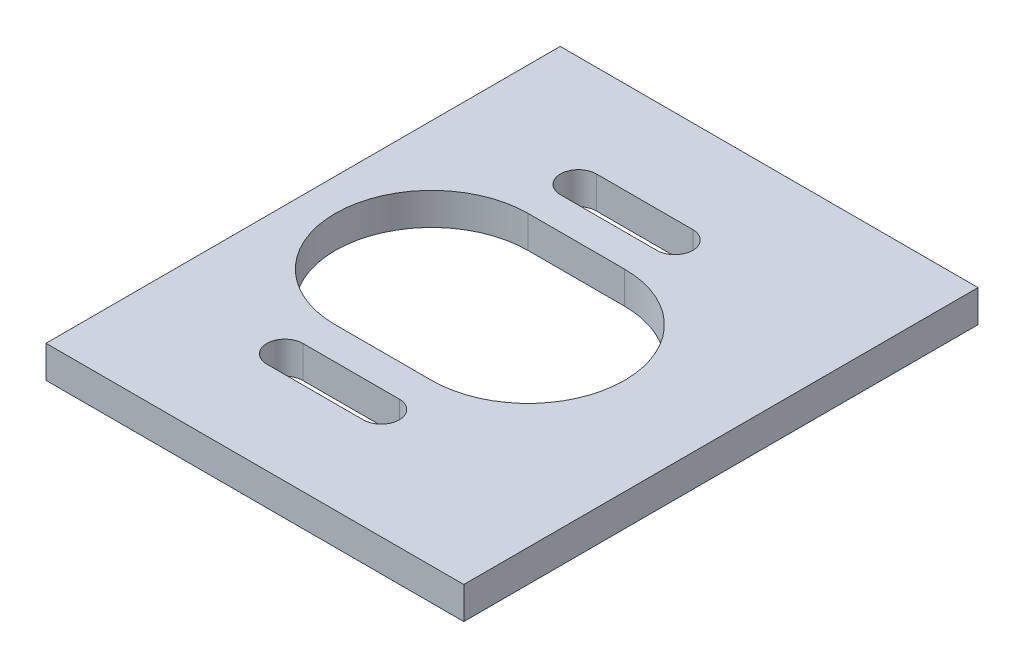
ISO-10303-21;
HEADER;
FILE_DESCRIPTION(('STEP AP214'),'2;1');
FILE_NAME('part.step','',(''),(''),'','','');
FILE_SCHEMA(('AUTOMOTIVE_DESIGN { 1 0 10303 214 1 1 1 1 }'));
ENDSEC;
DATA;
#1=APPLICATION_CONTEXT('core data for automotive mechanical design processes');
#2=APPLICATION_PROTOCOL_DEFINITION('international standard','automotive_design',2000,#1);
#3=PRODUCT_CONTEXT('',#1,'mechanical');
#4=PRODUCT('Part','Part','',(#3));
#5=PRODUCT_RELATED_PRODUCT_CATEGORY('part','',(#4));
#6=PRODUCT_DEFINITION_FORMATION('','',#4);
#7=PRODUCT_DEFINITION_CONTEXT('part definition',#1,'design');
#8=PRODUCT_DEFINITION('design','',#6,#7);
#9=PRODUCT_DEFINITION_SHAPE('','',#8);
#10=(LENGTH_UNIT() NAMED_UNIT(*) SI_UNIT(.MILLI.,.METRE.));
#11=(NAMED_UNIT(*) PLANE_ANGLE_UNIT() SI_UNIT($,.RADIAN.));
#12=(NAMED_UNIT(*) SI_UNIT($,.STERADIAN.) SOLID_ANGLE_UNIT());
#13=UNCERTAINTY_MEASURE_WITH_UNIT(LENGTH_MEASURE(1.E-05),#10,'distance_accuracy_value','');
#14=(GEOMETRIC_REPRESENTATION_CONTEXT(3) GLOBAL_UNCERTAINTY_ASSIGNED_CONTEXT((#13)) GLOBAL_UNIT_ASSIGNED_CONTEXT((#10,
#11,#12)) REPRESENTATION_CONTEXT('',''));
#15=CARTESIAN_POINT('',(0.,0.,0.));
#16=DIRECTION('',(0.,0.,1.));
#17=DIRECTION('',(1.,0.,0.));
#18=AXIS2_PLACEMENT_3D('',#15,#16,#17);
#19=CARTESIAN_POINT('',(0.,3.175,0.));
#20=DIRECTION('',(0.,1.,0.));
#21=DIRECTION('',(0.,0.,1.));
#22=AXIS2_PLACEMENT_3D('',#19,#20,#21);
#23=PLANE('',#22);
#24=DIRECTION('',(0.,0.,-1.));
#25=VECTOR('',#24,1.);
#26=CARTESIAN_POINT('',(53.975,3.175,-25.4));
#27=LINE('',#26,#25);
#28=CARTESIAN_POINT('',(53.975,3.175,25.4));
#29=VERTEX_POINT('',#28);
#30=CARTESIAN_POINT('',(53.975,3.175,-25.4));
#31=VERTEX_POINT('',#30);
#32=EDGE_CURVE('E174',#29,#31,#27,.T.);
#33=ORIENTED_EDGE('',*,*,#32,.F.);
#34=DIRECTION('',(1.,0.,0.));
#35=VECTOR('',#34,1.);
#36=CARTESIAN_POINT('',(-88.9,3.175,25.4));
#37=LINE('',#36,#35);
#38=CARTESIAN_POINT('',(95.25,3.175,25.4));
#39=VERTEX_POINT('',#38);
#40=EDGE_CURVE('E11',#29,#39,#37,.T.);
#41=ORIENTED_EDGE('',*,*,#40,.T.);
#42=DIRECTION('',(0.,0.,1.));
#43=VECTOR('',#42,1.);
#44=CARTESIAN_POINT('',(95.25,3.175,25.4));
#45=LINE('',#44,#43);
#46=CARTESIAN_POINT('',(95.25,3.175,-25.4));
#47=VERTEX_POINT('',#46);
#48=EDGE_CURVE('E169',#47,#39,#45,.T.);
#49=ORIENTED_EDGE('',*,*,#48,.F.);
#50=DIRECTION('',(-1.,0.,0.));
#51=VECTOR('',#50,1.);
#52=CARTESIAN_POINT('',(-88.9,3.175,-25.4));
#53=LINE('',#52,#51);
#54=EDGE_CURVE('E41',#47,#31,#53,.T.);
#55=ORIENTED_EDGE('',*,*,#54,.T.);
#56=EDGE_LOOP('',(#33,#41,#49,#55));
#57=FACE_BOUND('',#56,.T.);
#58=DIRECTION('',(1.,0.,0.));
#59=VECTOR('',#58,1.);
#60=CARTESIAN_POINT('',(76.2,3.175,12.722));
#61=LINE('',#60,#59);
#62=CARTESIAN_POINT('',(66.675,3.175,12.722));
#63=VERTEX_POINT('',#62);
#64=CARTESIAN_POINT('',(76.2,3.175,12.722));
#65=VERTEX_POINT('',#64);
#66=EDGE_CURVE('E253',#63,#65,#61,.T.);
#67=ORIENTED_EDGE('',*,*,#66,.T.);
#68=CARTESIAN_POINT('',(76.2,3.175,14.5));
#69=DIRECTION('',(0.,-1.,0.));
#70=DIRECTION('',(0.,0.,1.));
#71=AXIS2_PLACEMENT_3D('',#68,#69,#70);
#72=CIRCLE('',#71,1.77799999999999);
#73=CARTESIAN_POINT('',(76.2,3.175,16.278));
#74=VERTEX_POINT('',#73);
#75=EDGE_CURVE('E205',#65,#74,#72,.T.);
#76=ORIENTED_EDGE('',*,*,#75,.T.);
#77=DIRECTION('',(-1.,0.,0.));
#78=VECTOR('',#77,1.);
#79=CARTESIAN_POINT('',(76.2,3.175,16.278));
#80=LINE('',#79,#78);
#81=CARTESIAN_POINT('',(66.675,3.175,16.278));
#82=VERTEX_POINT('',#81);
#83=EDGE_CURVE('E243',#74,#82,#80,.T.);
#84=ORIENTED_EDGE('',*,*,#83,.T.);
#85=CARTESIAN_POINT('',(66.675,3.175,14.5));
#86=DIRECTION('',(0.,-1.,0.));
#87=DIRECTION('',(0.,0.,1.));
#88=AXIS2_PLACEMENT_3D('',#85,#86,#87);
#89=CIRCLE('',#88,1.77799999999997);
#90=EDGE_CURVE('E256',#82,#63,#89,.T.);
#91=ORIENTED_EDGE('',*,*,#90,.T.);
#92=EDGE_LOOP('',(#67,#76,#84,#91));
#93=FACE_BOUND('',#92,.T.);
#94=DIRECTION('',(-1.,0.,0.));
#95=VECTOR('',#94,1.);
#96=CARTESIAN_POINT('',(66.675,3.175,9.525));
#97=LINE('',#96,#95);
#98=CARTESIAN_POINT('',(76.2,3.175,9.525));
#99=VERTEX_POINT('',#98);
#100=CARTESIAN_POINT('',(66.675,3.175,9.525));
#101=VERTEX_POINT('',#100);
#102=EDGE_CURVE('E224',#99,#101,#97,.T.);
#103=ORIENTED_EDGE('',*,*,#102,.T.);
#104=CARTESIAN_POINT('',(66.675,3.175,0.));
#105=DIRECTION('',(0.,-1.,0.));
#106=DIRECTION('',(0.,0.,1.));
#107=AXIS2_PLACEMENT_3D('',#104,#105,#106);
#108=CIRCLE('',#107,9.525);
#109=CARTESIAN_POINT('',(66.675,3.175,-9.525));
#110=VERTEX_POINT('',#109);
#111=EDGE_CURVE('E179',#101,#110,#108,.T.);
#112=ORIENTED_EDGE('',*,*,#111,.T.);
#113=DIRECTION('',(1.,0.,0.));
#114=VECTOR('',#113,1.);
#115=CARTESIAN_POINT('',(66.675,3.175,-9.525));
#116=LINE('',#115,#114);
#117=CARTESIAN_POINT('',(76.2,3.175,-9.525));
#118=VERTEX_POINT('',#117);
#119=EDGE_CURVE('E214',#110,#118,#116,.T.);
#120=ORIENTED_EDGE('',*,*,#119,.T.);
#121=CARTESIAN_POINT('',(76.2,3.175,0.));
#122=DIRECTION('',(0.,-1.,0.));
#123=DIRECTION('',(0.,0.,1.));
#124=AXIS2_PLACEMENT_3D('',#121,#122,#123);
#125=CIRCLE('',#124,9.525);
#126=EDGE_CURVE('E227',#118,#99,#125,.T.);
#127=ORIENTED_EDGE('',*,*,#126,.T.);
#128=EDGE_LOOP('',(#103,#112,#120,#127));
#129=FACE_BOUND('',#128,.T.);
#130=DIRECTION('',(-1.,0.,0.));
#131=VECTOR('',#130,1.);
#132=CARTESIAN_POINT('',(66.675,3.175,-12.722));
#133=LINE('',#132,#131);
#134=CARTESIAN_POINT('',(76.2,3.175,-12.722));
#135=VERTEX_POINT('',#134);
#136=CARTESIAN_POINT('',(66.675,3.175,-12.722));
#137=VERTEX_POINT('',#136);
#138=EDGE_CURVE('E194',#135,#137,#133,.T.);
#139=ORIENTED_EDGE('',*,*,#138,.T.);
#140=CARTESIAN_POINT('',(66.675,3.175,-14.5));
#141=DIRECTION('',(0.,-1.,0.));
#142=DIRECTION('',(0.,0.,1.));
#143=AXIS2_PLACEMENT_3D('',#140,#141,#142);
#144=CIRCLE('',#143,1.778);
#145=CARTESIAN_POINT('',(66.675,3.175,-16.278));
#146=VERTEX_POINT('',#145);
#147=EDGE_CURVE('E57',#137,#146,#144,.T.);
#148=ORIENTED_EDGE('',*,*,#147,.T.);
#149=DIRECTION('',(1.,0.,0.));
#150=VECTOR('',#149,1.);
#151=CARTESIAN_POINT('',(66.675,3.175,-16.278));
#152=LINE('',#151,#150);
#153=CARTESIAN_POINT('',(76.2,3.175,-16.278));
#154=VERTEX_POINT('',#153);
#155=EDGE_CURVE('E185',#146,#154,#152,.T.);
#156=ORIENTED_EDGE('',*,*,#155,.T.);
#157=CARTESIAN_POINT('',(76.2,3.175,-14.5));
#158=DIRECTION('',(0.,-1.,0.));
#159=DIRECTION('',(0.,0.,1.));
#160=AXIS2_PLACEMENT_3D('',#157,#158,#159);
#161=CIRCLE('',#160,1.778);
#162=EDGE_CURVE('E198',#154,#135,#161,.T.);
#163=ORIENTED_EDGE('',*,*,#162,.T.);
#164=EDGE_LOOP('',(#139,#148,#156,#163));
#165=FACE_BOUND('',#164,.T.);
#166=ADVANCED_FACE('F32',(#57,#93,#129,#165),#23,.T.);
#167=CARTESIAN_POINT('',(0.,0.,0.));
#168=DIRECTION('',(0.,1.,0.));
#169=DIRECTION('',(0.,0.,1.));
#170=AXIS2_PLACEMENT_3D('',#167,#168,#169);
#171=PLANE('',#170);
#172=CARTESIAN_POINT('',(66.675,0.,0.));
#173=DIRECTION('',(0.,-1.,0.));
#174=DIRECTION('',(0.,0.,1.));
#175=AXIS2_PLACEMENT_3D('',#172,#173,#174);
#176=CIRCLE('',#175,9.525);
#177=CARTESIAN_POINT('',(66.675,0.,9.525));
#178=VERTEX_POINT('',#177);
#179=CARTESIAN_POINT('',(66.675,0.,-9.525));
#180=VERTEX_POINT('',#179);
#181=EDGE_CURVE('E211',#178,#180,#176,.T.);
#182=ORIENTED_EDGE('',*,*,#181,.F.);
#183=DIRECTION('',(-1.,0.,0.));
#184=VECTOR('',#183,1.);
#185=CARTESIAN_POINT('',(66.675,0.,9.525));
#186=LINE('',#185,#184);
#187=CARTESIAN_POINT('',(76.2,0.,9.525));
#188=VERTEX_POINT('',#187);
#189=EDGE_CURVE('E213',#188,#178,#186,.T.);
#190=ORIENTED_EDGE('',*,*,#189,.F.);
#191=CARTESIAN_POINT('',(76.2,0.,0.));
#192=DIRECTION('',(0.,-1.,0.));
#193=DIRECTION('',(0.,0.,1.));
#194=AXIS2_PLACEMENT_3D('',#191,#192,#193);
#195=CIRCLE('',#194,9.525);
#196=CARTESIAN_POINT('',(76.2,0.,-9.525));
#197=VERTEX_POINT('',#196);
#198=EDGE_CURVE('E216',#197,#188,#195,.T.);
#199=ORIENTED_EDGE('',*,*,#198,.F.);
#200=DIRECTION('',(1.,0.,0.));
#201=VECTOR('',#200,1.);
#202=CARTESIAN_POINT('',(66.675,0.,-9.525));
#203=LINE('',#202,#201);
#204=EDGE_CURVE('E219',#180,#197,#203,.T.);
#205=ORIENTED_EDGE('',*,*,#204,.F.);
#206=EDGE_LOOP('',(#182,#190,#199,#205));
#207=FACE_BOUND('',#206,.T.);
#208=DIRECTION('',(1.,0.,0.));
#209=VECTOR('',#208,1.);
#210=CARTESIAN_POINT('',(-88.9,0.,25.4));
#211=LINE('',#210,#209);
#212=CARTESIAN_POINT('',(53.975,0.,25.4));
#213=VERTEX_POINT('',#212);
#214=CARTESIAN_POINT('',(95.25,0.,25.4));
#215=VERTEX_POINT('',#214);
#216=EDGE_CURVE('E36',#213,#215,#211,.T.);
#217=ORIENTED_EDGE('',*,*,#216,.F.);
#218=DIRECTION('',(0.,0.,-1.));
#219=VECTOR('',#218,1.);
#220=CARTESIAN_POINT('',(53.975,0.,-25.4));
#221=LINE('',#220,#219);
#222=CARTESIAN_POINT('',(53.975,0.,-25.4));
#223=VERTEX_POINT('',#222);
#224=EDGE_CURVE('E49',#213,#223,#221,.T.);
#225=ORIENTED_EDGE('',*,*,#224,.T.);
#226=DIRECTION('',(-1.,0.,0.));
#227=VECTOR('',#226,1.);
#228=CARTESIAN_POINT('',(-88.9,0.,-25.4));
#229=LINE('',#228,#227);
#230=CARTESIAN_POINT('',(95.25,0.,-25.4));
#231=VERTEX_POINT('',#230);
#232=EDGE_CURVE('E155',#231,#223,#229,.T.);
#233=ORIENTED_EDGE('',*,*,#232,.F.);
#234=DIRECTION('',(0.,0.,-1.));
#235=VECTOR('',#234,1.);
#236=CARTESIAN_POINT('',(95.25,0.,25.4));
#237=LINE('',#236,#235);
#238=EDGE_CURVE('E157',#215,#231,#237,.T.);
#239=ORIENTED_EDGE('',*,*,#238,.F.);
#240=EDGE_LOOP('',(#217,#225,#233,#239));
#241=FACE_BOUND('',#240,.T.);
#242=CARTESIAN_POINT('',(76.2,0.,14.5));
#243=DIRECTION('',(0.,-1.,0.));
#244=DIRECTION('',(0.,0.,1.));
#245=AXIS2_PLACEMENT_3D('',#242,#243,#244);
#246=CIRCLE('',#245,1.77799999999999);
#247=CARTESIAN_POINT('',(76.2,0.,12.722));
#248=VERTEX_POINT('',#247);
#249=CARTESIAN_POINT('',(76.2,0.,16.278));
#250=VERTEX_POINT('',#249);
#251=EDGE_CURVE('E240',#248,#250,#246,.T.);
#252=ORIENTED_EDGE('',*,*,#251,.F.);
#253=DIRECTION('',(1.,0.,0.));
#254=VECTOR('',#253,1.);
#255=CARTESIAN_POINT('',(76.2,0.,12.722));
#256=LINE('',#255,#254);
#257=CARTESIAN_POINT('',(66.675,0.,12.722));
#258=VERTEX_POINT('',#257);
#259=EDGE_CURVE('E242',#258,#248,#256,.T.);
#260=ORIENTED_EDGE('',*,*,#259,.F.);
#261=CARTESIAN_POINT('',(66.675,0.,14.5));
#262=DIRECTION('',(0.,-1.,0.));
#263=DIRECTION('',(0.,0.,1.));
#264=AXIS2_PLACEMENT_3D('',#261,#262,#263);
#265=CIRCLE('',#264,1.77799999999997);
#266=CARTESIAN_POINT('',(66.675,0.,16.278));
#267=VERTEX_POINT('',#266);
#268=EDGE_CURVE('E245',#267,#258,#265,.T.);
#269=ORIENTED_EDGE('',*,*,#268,.F.);
#270=DIRECTION('',(-1.,0.,0.));
#271=VECTOR('',#270,1.);
#272=CARTESIAN_POINT('',(76.2,0.,16.278));
#273=LINE('',#272,#271);
#274=EDGE_CURVE('E248',#250,#267,#273,.T.);
#275=ORIENTED_EDGE('',*,*,#274,.F.);
#276=EDGE_LOOP('',(#252,#260,#269,#275));
#277=FACE_BOUND('',#276,.T.);
#278=CARTESIAN_POINT('',(66.675,0.,-14.5));
#279=DIRECTION('',(0.,-1.,0.));
#280=DIRECTION('',(0.,0.,1.));
#281=AXIS2_PLACEMENT_3D('',#278,#279,#280);
#282=CIRCLE('',#281,1.778);
#283=CARTESIAN_POINT('',(66.675,0.,-12.722));
#284=VERTEX_POINT('',#283);
#285=CARTESIAN_POINT('',(66.675,0.,-16.278));
#286=VERTEX_POINT('',#285);
#287=EDGE_CURVE('E182',#284,#286,#282,.T.);
#288=ORIENTED_EDGE('',*,*,#287,.F.);
#289=DIRECTION('',(-1.,0.,0.));
#290=VECTOR('',#289,1.);
#291=CARTESIAN_POINT('',(66.675,0.,-12.722));
#292=LINE('',#291,#290);
#293=CARTESIAN_POINT('',(76.2,0.,-12.722));
#294=VERTEX_POINT('',#293);
#295=EDGE_CURVE('E184',#294,#284,#292,.T.);
#296=ORIENTED_EDGE('',*,*,#295,.F.);
#297=CARTESIAN_POINT('',(76.2,0.,-14.5));
#298=DIRECTION('',(0.,-1.,0.));
#299=DIRECTION('',(0.,0.,1.));
#300=AXIS2_PLACEMENT_3D('',#297,#298,#299);
#301=CIRCLE('',#300,1.778);
#302=CARTESIAN_POINT('',(76.2,0.,-16.278));
#303=VERTEX_POINT('',#302);
#304=EDGE_CURVE('E187',#303,#294,#301,.T.);
#305=ORIENTED_EDGE('',*,*,#304,.F.);
#306=DIRECTION('',(1.,0.,0.));
#307=VECTOR('',#306,1.);
#308=CARTESIAN_POINT('',(66.675,0.,-16.278));
#309=LINE('',#308,#307);
#310=EDGE_CURVE('E190',#286,#303,#309,.T.);
#311=ORIENTED_EDGE('',*,*,#310,.F.);
#312=EDGE_LOOP('',(#288,#296,#305,#311));
#313=FACE_BOUND('',#312,.T.);
#314=ADVANCED_FACE('F158',(#207,#241,#277,#313),#171,.F.);
#315=CARTESIAN_POINT('',(-88.9,3.175,-25.4));
#316=DIRECTION('',(0.,0.,1.));
#317=DIRECTION('',(1.,0.,0.));
#318=AXIS2_PLACEMENT_3D('',#315,#316,#317);
#319=PLANE('',#318);
#320=ORIENTED_EDGE('',*,*,#232,.T.);
#321=DIRECTION('',(0.,1.,0.));
#322=VECTOR('',#321,1.);
#323=CARTESIAN_POINT('',(53.975,0.,-25.4));
#324=LINE('',#323,#322);
#325=EDGE_CURVE('E176',#223,#31,#324,.T.);
#326=ORIENTED_EDGE('',*,*,#325,.T.);
#327=ORIENTED_EDGE('',*,*,#54,.F.);
#328=DIRECTION('',(0.,1.,0.));
#329=VECTOR('',#328,1.);
#330=CARTESIAN_POINT('',(95.25,3.175,-25.4));
#331=LINE('',#330,#329);
#332=EDGE_CURVE('E164',#231,#47,#331,.T.);
#333=ORIENTED_EDGE('',*,*,#332,.F.);
#334=EDGE_LOOP('',(#320,#326,#327,#333));
#335=FACE_BOUND('',#334,.T.);
#336=ADVANCED_FACE('F34',(#335),#319,.F.);
#337=CARTESIAN_POINT('',(-88.9,3.175,25.4));
#338=DIRECTION('',(0.,0.,-1.));
#339=DIRECTION('',(-1.,0.,0.));
#340=AXIS2_PLACEMENT_3D('',#337,#338,#339);
#341=PLANE('',#340);
#342=ORIENTED_EDGE('',*,*,#40,.F.);
#343=DIRECTION('',(0.,1.,0.));
#344=VECTOR('',#343,1.);
#345=CARTESIAN_POINT('',(53.975,0.,25.4));
#346=LINE('',#345,#344);
#347=EDGE_CURVE('E153',#213,#29,#346,.T.);
#348=ORIENTED_EDGE('',*,*,#347,.F.);
#349=ORIENTED_EDGE('',*,*,#216,.T.);
#350=DIRECTION('',(0.,-1.,0.));
#351=VECTOR('',#350,1.);
#352=CARTESIAN_POINT('',(95.25,3.175,25.4));
#353=LINE('',#352,#351);
#354=EDGE_CURVE('E152',#39,#215,#353,.T.);
#355=ORIENTED_EDGE('',*,*,#354,.F.);
#356=EDGE_LOOP('',(#342,#348,#349,#355));
#357=FACE_BOUND('',#356,.T.);
#358=ADVANCED_FACE('F150',(#357),#341,.F.);
#359=CARTESIAN_POINT('',(76.2,0.,14.5));
#360=DIRECTION('',(0.,1.,0.));
#361=DIRECTION('',(0.,0.,1.));
#362=AXIS2_PLACEMENT_3D('',#359,#360,#361);
#363=CYLINDRICAL_SURFACE('',#362,1.77799999999999);
#364=ORIENTED_EDGE('',*,*,#75,.F.);
#365=DIRECTION('',(0.,1.,0.));
#366=VECTOR('',#365,1.);
#367=CARTESIAN_POINT('',(76.2,0.,12.722));
#368=LINE('',#367,#366);
#369=EDGE_CURVE('E250',#248,#65,#368,.T.);
#370=ORIENTED_EDGE('',*,*,#369,.F.);
#371=ORIENTED_EDGE('',*,*,#251,.T.);
#372=DIRECTION('',(0.,1.,0.));
#373=VECTOR('',#372,1.);
#374=CARTESIAN_POINT('',(76.2,0.,16.278));
#375=LINE('',#374,#373);
#376=EDGE_CURVE('E261',#250,#74,#375,.T.);
#377=ORIENTED_EDGE('',*,*,#376,.T.);
#378=EDGE_LOOP('',(#364,#370,#371,#377));
#379=FACE_BOUND('',#378,.T.);
#380=ADVANCED_FACE('F296',(#379),#363,.F.);
#381=CARTESIAN_POINT('',(76.2,0.,16.278));
#382=DIRECTION('',(0.,0.,-1.));
#383=DIRECTION('',(-1.,0.,0.));
#384=AXIS2_PLACEMENT_3D('',#381,#382,#383);
#385=PLANE('',#384);
#386=ORIENTED_EDGE('',*,*,#83,.F.);
#387=ORIENTED_EDGE('',*,*,#376,.F.);
#388=ORIENTED_EDGE('',*,*,#274,.T.);
#389=DIRECTION('',(0.,1.,0.));
#390=VECTOR('',#389,1.);
#391=CARTESIAN_POINT('',(66.675,0.,16.278));
#392=LINE('',#391,#390);
#393=EDGE_CURVE('E264',#267,#82,#392,.T.);
#394=ORIENTED_EDGE('',*,*,#393,.T.);
#395=EDGE_LOOP('',(#386,#387,#388,#394));
#396=FACE_BOUND('',#395,.T.);
#397=ADVANCED_FACE('F303',(#396),#385,.T.);
#398=CARTESIAN_POINT('',(66.675,0.,14.5));
#399=DIRECTION('',(0.,1.,0.));
#400=DIRECTION('',(0.,0.,1.));
#401=AXIS2_PLACEMENT_3D('',#398,#399,#400);
#402=CYLINDRICAL_SURFACE('',#401,1.77799999999997);
#403=ORIENTED_EDGE('',*,*,#90,.F.);
#404=ORIENTED_EDGE('',*,*,#393,.F.);
#405=ORIENTED_EDGE('',*,*,#268,.T.);
#406=DIRECTION('',(0.,1.,0.));
#407=VECTOR('',#406,1.);
#408=CARTESIAN_POINT('',(66.675,0.,12.722));
#409=LINE('',#408,#407);
#410=EDGE_CURVE('E266',#258,#63,#409,.T.);
#411=ORIENTED_EDGE('',*,*,#410,.T.);
#412=EDGE_LOOP('',(#403,#404,#405,#411));
#413=FACE_BOUND('',#412,.T.);
#414=ADVANCED_FACE('F404',(#413),#402,.F.);
#415=CARTESIAN_POINT('',(76.2,0.,12.722));
#416=DIRECTION('',(0.,0.,1.));
#417=DIRECTION('',(1.,0.,0.));
#418=AXIS2_PLACEMENT_3D('',#415,#416,#417);
#419=PLANE('',#418);
#420=ORIENTED_EDGE('',*,*,#66,.F.);
#421=ORIENTED_EDGE('',*,*,#410,.F.);
#422=ORIENTED_EDGE('',*,*,#259,.T.);
#423=ORIENTED_EDGE('',*,*,#369,.T.);
#424=EDGE_LOOP('',(#420,#421,#422,#423));
#425=FACE_BOUND('',#424,.T.);
#426=ADVANCED_FACE('F394',(#425),#419,.T.);
#427=CARTESIAN_POINT('',(66.675,0.,0.));
#428=DIRECTION('',(0.,1.,0.));
#429=DIRECTION('',(0.,0.,1.));
#430=AXIS2_PLACEMENT_3D('',#427,#428,#429);
#431=CYLINDRICAL_SURFACE('',#430,9.525);
#432=ORIENTED_EDGE('',*,*,#111,.F.);
#433=DIRECTION('',(0.,1.,0.));
#434=VECTOR('',#433,1.);
#435=CARTESIAN_POINT('',(66.675,0.,9.525));
#436=LINE('',#435,#434);
#437=EDGE_CURVE('E221',#178,#101,#436,.T.);
#438=ORIENTED_EDGE('',*,*,#437,.F.);
#439=ORIENTED_EDGE('',*,*,#181,.T.);
#440=DIRECTION('',(0.,1.,0.));
#441=VECTOR('',#440,1.);
#442=CARTESIAN_POINT('',(66.675,0.,-9.525));
#443=LINE('',#442,#441);
#444=EDGE_CURVE('E195',#180,#110,#443,.T.);
#445=ORIENTED_EDGE('',*,*,#444,.T.);
#446=EDGE_LOOP('',(#432,#438,#439,#445));
#447=FACE_BOUND('',#446,.T.);
#448=ADVANCED_FACE('F384',(#447),#431,.F.);
#449=CARTESIAN_POINT('',(66.675,0.,-9.525));
#450=DIRECTION('',(0.,0.,1.));
#451=DIRECTION('',(1.,0.,0.));
#452=AXIS2_PLACEMENT_3D('',#449,#450,#451);
#453=PLANE('',#452);
#454=ORIENTED_EDGE('',*,*,#119,.F.);
#455=ORIENTED_EDGE('',*,*,#444,.F.);
#456=ORIENTED_EDGE('',*,*,#204,.T.);
#457=DIRECTION('',(0.,1.,0.));
#458=VECTOR('',#457,1.);
#459=CARTESIAN_POINT('',(76.2,0.,-9.525));
#460=LINE('',#459,#458);
#461=EDGE_CURVE('E234',#197,#118,#460,.T.);
#462=ORIENTED_EDGE('',*,*,#461,.T.);
#463=EDGE_LOOP('',(#454,#455,#456,#462));
#464=FACE_BOUND('',#463,.T.);
#465=ADVANCED_FACE('F374',(#464),#453,.T.);
#466=CARTESIAN_POINT('',(76.2,0.,0.));
#467=DIRECTION('',(0.,1.,0.));
#468=DIRECTION('',(0.,0.,1.));
#469=AXIS2_PLACEMENT_3D('',#466,#467,#468);
#470=CYLINDRICAL_SURFACE('',#469,9.525);
#471=ORIENTED_EDGE('',*,*,#126,.F.);
#472=ORIENTED_EDGE('',*,*,#461,.F.);
#473=ORIENTED_EDGE('',*,*,#198,.T.);
#474=DIRECTION('',(0.,1.,0.));
#475=VECTOR('',#474,1.);
#476=CARTESIAN_POINT('',(76.2,0.,9.525));
#477=LINE('',#476,#475);
#478=EDGE_CURVE('E236',#188,#99,#477,.T.);
#479=ORIENTED_EDGE('',*,*,#478,.T.);
#480=EDGE_LOOP('',(#471,#472,#473,#479));
#481=FACE_BOUND('',#480,.T.);
#482=ADVANCED_FACE('F364',(#481),#470,.F.);
#483=CARTESIAN_POINT('',(66.675,0.,9.525));
#484=DIRECTION('',(0.,0.,-1.));
#485=DIRECTION('',(-1.,0.,0.));
#486=AXIS2_PLACEMENT_3D('',#483,#484,#485);
#487=PLANE('',#486);
#488=ORIENTED_EDGE('',*,*,#102,.F.);
#489=ORIENTED_EDGE('',*,*,#478,.F.);
#490=ORIENTED_EDGE('',*,*,#189,.T.);
#491=ORIENTED_EDGE('',*,*,#437,.T.);
#492=EDGE_LOOP('',(#488,#489,#490,#491));
#493=FACE_BOUND('',#492,.T.);
#494=ADVANCED_FACE('F355',(#493),#487,.T.);
#495=CARTESIAN_POINT('',(66.675,0.,-14.5));
#496=DIRECTION('',(0.,1.,0.));
#497=DIRECTION('',(0.,0.,1.));
#498=AXIS2_PLACEMENT_3D('',#495,#496,#497);
#499=CYLINDRICAL_SURFACE('',#498,1.778);
#500=ORIENTED_EDGE('',*,*,#147,.F.);
#501=DIRECTION('',(0.,1.,0.));
#502=VECTOR('',#501,1.);
#503=CARTESIAN_POINT('',(66.675,0.,-12.722));
#504=LINE('',#503,#502);
#505=EDGE_CURVE('E192',#284,#137,#504,.T.);
#506=ORIENTED_EDGE('',*,*,#505,.F.);
#507=ORIENTED_EDGE('',*,*,#287,.T.);
#508=DIRECTION('',(0.,1.,0.));
#509=VECTOR('',#508,1.);
#510=CARTESIAN_POINT('',(66.675,0.,-16.278));
#511=LINE('',#510,#509);
#512=EDGE_CURVE('E203',#286,#146,#511,.T.);
#513=ORIENTED_EDGE('',*,*,#512,.T.);
#514=EDGE_LOOP('',(#500,#506,#507,#513));
#515=FACE_BOUND('',#514,.T.);
#516=ADVANCED_FACE('F346',(#515),#499,.F.);
#517=CARTESIAN_POINT('',(66.675,0.,-16.278));
#518=DIRECTION('',(0.,0.,1.));
#519=DIRECTION('',(1.,0.,0.));
#520=AXIS2_PLACEMENT_3D('',#517,#518,#519);
#521=PLANE('',#520);
#522=ORIENTED_EDGE('',*,*,#155,.F.);
#523=ORIENTED_EDGE('',*,*,#512,.F.);
#524=ORIENTED_EDGE('',*,*,#310,.T.);
#525=DIRECTION('',(0.,1.,0.));
#526=VECTOR('',#525,1.);
#527=CARTESIAN_POINT('',(76.2,0.,-16.278));
#528=LINE('',#527,#526);
#529=EDGE_CURVE('E206',#303,#154,#528,.T.);
#530=ORIENTED_EDGE('',*,*,#529,.T.);
#531=EDGE_LOOP('',(#522,#523,#524,#530));
#532=FACE_BOUND('',#531,.T.);
#533=ADVANCED_FACE('F336',(#532),#521,.T.);
#534=CARTESIAN_POINT('',(76.2,0.,-14.5));
#535=DIRECTION('',(0.,1.,0.));
#536=DIRECTION('',(0.,0.,1.));
#537=AXIS2_PLACEMENT_3D('',#534,#535,#536);
#538=CYLINDRICAL_SURFACE('',#537,1.778);
#539=ORIENTED_EDGE('',*,*,#162,.F.);
#540=ORIENTED_EDGE('',*,*,#529,.F.);
#541=ORIENTED_EDGE('',*,*,#304,.T.);
#542=DIRECTION('',(0.,1.,0.));
#543=VECTOR('',#542,1.);
#544=CARTESIAN_POINT('',(76.2,0.,-12.722));
#545=LINE('',#544,#543);
#546=EDGE_CURVE('E208',#294,#135,#545,.T.);
#547=ORIENTED_EDGE('',*,*,#546,.T.);
#548=EDGE_LOOP('',(#539,#540,#541,#547));
#549=FACE_BOUND('',#548,.T.);
#550=ADVANCED_FACE('F284',(#549),#538,.F.);
#551=CARTESIAN_POINT('',(66.675,0.,-12.722));
#552=DIRECTION('',(0.,0.,-1.));
#553=DIRECTION('',(-1.,0.,0.));
#554=AXIS2_PLACEMENT_3D('',#551,#552,#553);
#555=PLANE('',#554);
#556=ORIENTED_EDGE('',*,*,#138,.F.);
#557=ORIENTED_EDGE('',*,*,#546,.F.);
#558=ORIENTED_EDGE('',*,*,#295,.T.);
#559=ORIENTED_EDGE('',*,*,#505,.T.);
#560=EDGE_LOOP('',(#556,#557,#558,#559));
#561=FACE_BOUND('',#560,.T.);
#562=ADVANCED_FACE('F277',(#561),#555,.T.);
#563=CARTESIAN_POINT('',(53.975,0.,-25.4));
#564=DIRECTION('',(1.,0.,0.));
#565=DIRECTION('',(0.,0.,-1.));
#566=AXIS2_PLACEMENT_3D('',#563,#564,#565);
#567=PLANE('',#566);
#568=ORIENTED_EDGE('',*,*,#32,.T.);
#569=ORIENTED_EDGE('',*,*,#325,.F.);
#570=ORIENTED_EDGE('',*,*,#224,.F.);
#571=ORIENTED_EDGE('',*,*,#347,.T.);
#572=EDGE_LOOP('',(#568,#569,#570,#571));
#573=FACE_BOUND('',#572,.T.);
#574=ADVANCED_FACE('F275',(#573),#567,.F.);
#575=CARTESIAN_POINT('',(95.25,0.,0.));
#576=DIRECTION('',(1.,0.,0.));
#577=DIRECTION('',(0.,0.,-1.));
#578=AXIS2_PLACEMENT_3D('',#575,#576,#577);
#579=PLANE('',#578);
#580=ORIENTED_EDGE('',*,*,#354,.T.);
#581=ORIENTED_EDGE('',*,*,#238,.T.);
#582=ORIENTED_EDGE('',*,*,#332,.T.);
#583=ORIENTED_EDGE('',*,*,#48,.T.);
#584=EDGE_LOOP('',(#580,#581,#582,#583));
#585=FACE_BOUND('',#584,.T.);
#586=ADVANCED_FACE('F167',(#585),#579,.T.);
#587=CLOSED_SHELL('',(#166,#314,#336,#358,#380,#397,#414,#426,#448,#465,#482,#494,#516,#533,
#550,#562,#574,#586));
#588=MANIFOLD_SOLID_BREP('B2',#587);
#589=ADVANCED_BREP_SHAPE_REPRESENTATION('',(#18,#588),#14);
#590=SHAPE_DEFINITION_REPRESENTATION(#9,#589);
ENDSEC;
END-ISO-10303-21;
